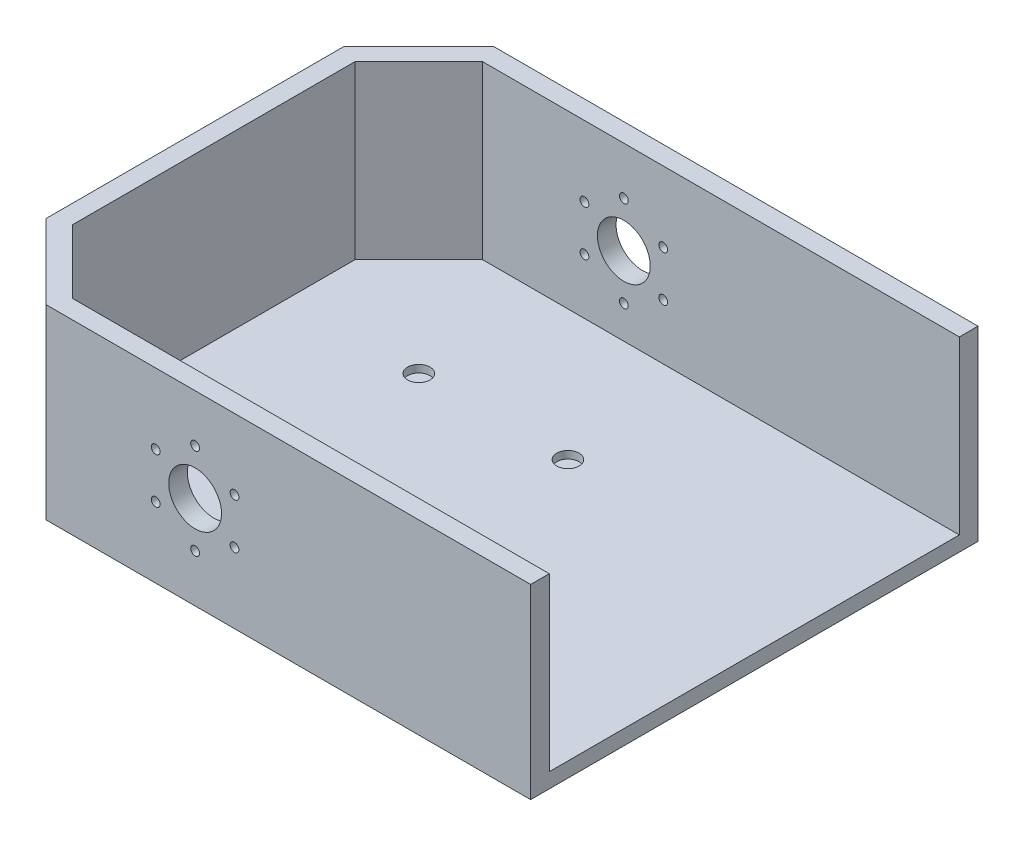
ISO-10303-21;
HEADER;
FILE_DESCRIPTION(('STEP AP214'),'2;1');
FILE_NAME('part.step','',(''),(''),'','','');
FILE_SCHEMA(('AUTOMOTIVE_DESIGN { 1 0 10303 214 1 1 1 1 }'));
ENDSEC;
DATA;
#1=APPLICATION_CONTEXT('core data for automotive mechanical design processes');
#2=APPLICATION_PROTOCOL_DEFINITION('international standard','automotive_design',2000,#1);
#3=PRODUCT_CONTEXT('',#1,'mechanical');
#4=PRODUCT('Part','Part','',(#3));
#5=PRODUCT_RELATED_PRODUCT_CATEGORY('part','',(#4));
#6=PRODUCT_DEFINITION_FORMATION('','',#4);
#7=PRODUCT_DEFINITION_CONTEXT('part definition',#1,'design');
#8=PRODUCT_DEFINITION('design','',#6,#7);
#9=PRODUCT_DEFINITION_SHAPE('','',#8);
#10=(LENGTH_UNIT() NAMED_UNIT(*) SI_UNIT(.MILLI.,.METRE.));
#11=(NAMED_UNIT(*) PLANE_ANGLE_UNIT() SI_UNIT($,.RADIAN.));
#12=(NAMED_UNIT(*) SI_UNIT($,.STERADIAN.) SOLID_ANGLE_UNIT());
#13=UNCERTAINTY_MEASURE_WITH_UNIT(LENGTH_MEASURE(1.E-05),#10,'distance_accuracy_value','');
#14=(GEOMETRIC_REPRESENTATION_CONTEXT(3) GLOBAL_UNCERTAINTY_ASSIGNED_CONTEXT((#13)) GLOBAL_UNIT_ASSIGNED_CONTEXT((#10,
#11,#12)) REPRESENTATION_CONTEXT('',''));
#15=CARTESIAN_POINT('',(0.,0.,0.));
#16=DIRECTION('',(0.,0.,1.));
#17=DIRECTION('',(1.,0.,0.));
#18=AXIS2_PLACEMENT_3D('',#15,#16,#17);
#19=CARTESIAN_POINT('',(-127.,5.08,-76.2));
#20=DIRECTION('',(1.,0.,0.));
#21=DIRECTION('',(0.,0.,-1.));
#22=AXIS2_PLACEMENT_3D('',#19,#20,#21);
#23=PLANE('',#22);
#24=DIRECTION('',(0.,1.,0.));
#25=VECTOR('',#24,1.);
#26=CARTESIAN_POINT('',(-127.,5.08,50.7999999999999));
#27=LINE('',#26,#25);
#28=CARTESIAN_POINT('',(-127.,0.,50.7999999999999));
#29=VERTEX_POINT('',#28);
#30=CARTESIAN_POINT('',(-127.,63.5,50.7999999999999));
#31=VERTEX_POINT('',#30);
#32=EDGE_CURVE('E222',#29,#31,#27,.T.);
#33=ORIENTED_EDGE('',*,*,#32,.T.);
#34=DIRECTION('',(0.,0.,1.));
#35=VECTOR('',#34,1.);
#36=CARTESIAN_POINT('',(-127.,63.5,-50.8));
#37=LINE('',#36,#35);
#38=CARTESIAN_POINT('',(-127.,63.5,-50.8));
#39=VERTEX_POINT('',#38);
#40=EDGE_CURVE('E166',#39,#31,#37,.T.);
#41=ORIENTED_EDGE('',*,*,#40,.F.);
#42=DIRECTION('',(0.,-1.,0.));
#43=VECTOR('',#42,1.);
#44=CARTESIAN_POINT('',(-127.,5.08,-50.8));
#45=LINE('',#44,#43);
#46=CARTESIAN_POINT('',(-127.,0.,-50.8));
#47=VERTEX_POINT('',#46);
#48=EDGE_CURVE('E224',#39,#47,#45,.T.);
#49=ORIENTED_EDGE('',*,*,#48,.T.);
#50=DIRECTION('',(0.,0.,1.));
#51=VECTOR('',#50,1.);
#52=CARTESIAN_POINT('',(-127.,0.,-76.2));
#53=LINE('',#52,#51);
#54=EDGE_CURVE('E212',#47,#29,#53,.T.);
#55=ORIENTED_EDGE('',*,*,#54,.T.);
#56=EDGE_LOOP('',(#33,#41,#49,#55));
#57=FACE_BOUND('',#56,.T.);
#58=ADVANCED_FACE('F41',(#57),#23,.F.);
#59=CARTESIAN_POINT('',(-127.,5.08,76.2));
#60=DIRECTION('',(0.,0.,-1.));
#61=DIRECTION('',(-1.,0.,0.));
#62=AXIS2_PLACEMENT_3D('',#59,#60,#61);
#63=PLANE('',#62);
#64=CARTESIAN_POINT('',(-64.2233937586584,39.4999999999996,76.2));
#65=DIRECTION('',(0.,0.,1.));
#66=DIRECTION('',(1.,0.,0.));
#67=AXIS2_PLACEMENT_3D('',#64,#65,#66);
#68=CIRCLE('',#67,1.50000000000001);
#69=CARTESIAN_POINT('',(-62.7233937586583,39.4999999999996,76.2));
#70=VERTEX_POINT('',#69);
#71=EDGE_CURVE('E280',#70,#70,#68,.T.);
#72=ORIENTED_EDGE('',*,*,#71,.F.);
#73=EDGE_LOOP('',(#72));
#74=FACE_BOUND('',#73,.T.);
#75=CARTESIAN_POINT('',(-64.2233937586579,23.9999999999996,76.2));
#76=DIRECTION('',(0.,0.,1.));
#77=DIRECTION('',(1.,0.,0.));
#78=AXIS2_PLACEMENT_3D('',#75,#76,#77);
#79=CIRCLE('',#78,1.50000000000002);
#80=CARTESIAN_POINT('',(-62.7233937586579,23.9999999999996,76.2));
#81=VERTEX_POINT('',#80);
#82=EDGE_CURVE('E287',#81,#81,#79,.T.);
#83=ORIENTED_EDGE('',*,*,#82,.F.);
#84=EDGE_LOOP('',(#83));
#85=FACE_BOUND('',#84,.T.);
#86=CARTESIAN_POINT('',(-50.7999999999988,16.25,76.2));
#87=DIRECTION('',(0.,0.,1.));
#88=DIRECTION('',(1.,0.,0.));
#89=AXIS2_PLACEMENT_3D('',#86,#87,#88);
#90=CIRCLE('',#89,1.5);
#91=CARTESIAN_POINT('',(-49.2999999999988,16.25,76.2));
#92=VERTEX_POINT('',#91);
#93=EDGE_CURVE('E293',#92,#92,#90,.T.);
#94=ORIENTED_EDGE('',*,*,#93,.F.);
#95=EDGE_LOOP('',(#94));
#96=FACE_BOUND('',#95,.T.);
#97=CARTESIAN_POINT('',(-37.3766062413402,24.0000000000005,76.2));
#98=DIRECTION('',(0.,0.,1.));
#99=DIRECTION('',(1.,0.,0.));
#100=AXIS2_PLACEMENT_3D('',#97,#98,#99);
#101=CIRCLE('',#100,1.50000000000001);
#102=CARTESIAN_POINT('',(-35.8766062413402,24.0000000000005,76.2));
#103=VERTEX_POINT('',#102);
#104=EDGE_CURVE('E299',#103,#103,#101,.T.);
#105=ORIENTED_EDGE('',*,*,#104,.F.);
#106=EDGE_LOOP('',(#105));
#107=FACE_BOUND('',#106,.T.);
#108=CARTESIAN_POINT('',(-37.3766062413408,39.5000000000005,76.2));
#109=DIRECTION('',(0.,0.,1.));
#110=DIRECTION('',(1.,0.,0.));
#111=AXIS2_PLACEMENT_3D('',#108,#109,#110);
#112=CIRCLE('',#111,1.5);
#113=CARTESIAN_POINT('',(-35.8766062413409,39.5000000000005,76.2));
#114=VERTEX_POINT('',#113);
#115=EDGE_CURVE('E305',#114,#114,#112,.T.);
#116=ORIENTED_EDGE('',*,*,#115,.F.);
#117=EDGE_LOOP('',(#116));
#118=FACE_BOUND('',#117,.T.);
#119=CARTESIAN_POINT('',(-50.8,47.25,76.2));
#120=DIRECTION('',(0.,0.,1.));
#121=DIRECTION('',(1.,0.,0.));
#122=AXIS2_PLACEMENT_3D('',#119,#120,#121);
#123=CIRCLE('',#122,1.5);
#124=CARTESIAN_POINT('',(-49.3,47.25,76.2));
#125=VERTEX_POINT('',#124);
#126=EDGE_CURVE('E274',#125,#125,#123,.T.);
#127=ORIENTED_EDGE('',*,*,#126,.F.);
#128=EDGE_LOOP('',(#127));
#129=FACE_BOUND('',#128,.T.);
#130=CARTESIAN_POINT('',(-50.8,31.75,76.2));
#131=DIRECTION('',(0.,0.,1.));
#132=DIRECTION('',(1.,0.,0.));
#133=AXIS2_PLACEMENT_3D('',#130,#131,#132);
#134=CIRCLE('',#133,9.);
#135=CARTESIAN_POINT('',(-41.8,31.75,76.2));
#136=VERTEX_POINT('',#135);
#137=EDGE_CURVE('E271',#136,#136,#134,.T.);
#138=ORIENTED_EDGE('',*,*,#137,.F.);
#139=EDGE_LOOP('',(#138));
#140=FACE_BOUND('',#139,.T.);
#141=DIRECTION('',(0.,-1.,0.));
#142=VECTOR('',#141,1.);
#143=CARTESIAN_POINT('',(63.5,5.08,76.2));
#144=LINE('',#143,#142);
#145=CARTESIAN_POINT('',(63.5,63.5,76.2));
#146=VERTEX_POINT('',#145);
#147=CARTESIAN_POINT('',(63.5,0.,76.2));
#148=VERTEX_POINT('',#147);
#149=EDGE_CURVE('E143',#146,#148,#144,.T.);
#150=ORIENTED_EDGE('',*,*,#149,.F.);
#151=DIRECTION('',(1.,0.,0.));
#152=VECTOR('',#151,1.);
#153=CARTESIAN_POINT('',(-101.6,63.5,76.2));
#154=LINE('',#153,#152);
#155=CARTESIAN_POINT('',(-101.6,63.5,76.2));
#156=VERTEX_POINT('',#155);
#157=EDGE_CURVE('E172',#156,#146,#154,.T.);
#158=ORIENTED_EDGE('',*,*,#157,.F.);
#159=DIRECTION('',(0.,-1.,0.));
#160=VECTOR('',#159,1.);
#161=CARTESIAN_POINT('',(-101.6,5.08,76.2));
#162=LINE('',#161,#160);
#163=CARTESIAN_POINT('',(-101.6,0.,76.2));
#164=VERTEX_POINT('',#163);
#165=EDGE_CURVE('E11',#156,#164,#162,.T.);
#166=ORIENTED_EDGE('',*,*,#165,.T.);
#167=DIRECTION('',(1.,0.,0.));
#168=VECTOR('',#167,1.);
#169=CARTESIAN_POINT('',(-127.,0.,76.2));
#170=LINE('',#169,#168);
#171=EDGE_CURVE('E217',#164,#148,#170,.T.);
#172=ORIENTED_EDGE('',*,*,#171,.T.);
#173=EDGE_LOOP('',(#150,#158,#166,#172));
#174=FACE_BOUND('',#173,.T.);
#175=ADVANCED_FACE('F366',(#74,#85,#96,#107,#118,#129,#140,#174),#63,.F.);
#176=CARTESIAN_POINT('',(63.5,5.08,-76.2));
#177=DIRECTION('',(-1.,0.,0.));
#178=DIRECTION('',(0.,0.,1.));
#179=AXIS2_PLACEMENT_3D('',#176,#177,#178);
#180=PLANE('',#179);
#181=DIRECTION('',(0.,0.,-1.));
#182=VECTOR('',#181,1.);
#183=CARTESIAN_POINT('',(63.5,0.,-76.2));
#184=LINE('',#183,#182);
#185=CARTESIAN_POINT('',(63.5,0.,-76.2));
#186=VERTEX_POINT('',#185);
#187=EDGE_CURVE('E139',#148,#186,#184,.T.);
#188=ORIENTED_EDGE('',*,*,#187,.T.);
#189=DIRECTION('',(0.,-1.,0.));
#190=VECTOR('',#189,1.);
#191=CARTESIAN_POINT('',(63.5,5.08,-76.2));
#192=LINE('',#191,#190);
#193=CARTESIAN_POINT('',(63.5,63.5,-76.2));
#194=VERTEX_POINT('',#193);
#195=EDGE_CURVE('E131',#194,#186,#192,.T.);
#196=ORIENTED_EDGE('',*,*,#195,.F.);
#197=DIRECTION('',(0.,0.,-1.));
#198=VECTOR('',#197,1.);
#199=CARTESIAN_POINT('',(63.5,63.5,-69.85));
#200=LINE('',#199,#198);
#201=CARTESIAN_POINT('',(63.5,63.5,-69.85));
#202=VERTEX_POINT('',#201);
#203=EDGE_CURVE('E136',#202,#194,#200,.T.);
#204=ORIENTED_EDGE('',*,*,#203,.F.);
#205=DIRECTION('',(0.,-1.,0.));
#206=VECTOR('',#205,1.);
#207=CARTESIAN_POINT('',(63.5,63.5,-69.85));
#208=LINE('',#207,#206);
#209=CARTESIAN_POINT('',(63.5,5.08,-69.85));
#210=VERTEX_POINT('',#209);
#211=EDGE_CURVE('E186',#202,#210,#208,.T.);
#212=ORIENTED_EDGE('',*,*,#211,.T.);
#213=DIRECTION('',(0.,0.,-1.));
#214=VECTOR('',#213,1.);
#215=CARTESIAN_POINT('',(63.5,5.08,-76.2));
#216=LINE('',#215,#214);
#217=CARTESIAN_POINT('',(63.5,5.08,69.85));
#218=VERTEX_POINT('',#217);
#219=EDGE_CURVE('E144',#218,#210,#216,.T.);
#220=ORIENTED_EDGE('',*,*,#219,.F.);
#221=DIRECTION('',(0.,-1.,0.));
#222=VECTOR('',#221,1.);
#223=CARTESIAN_POINT('',(63.5,63.5,69.85));
#224=LINE('',#223,#222);
#225=CARTESIAN_POINT('',(63.5,63.5,69.85));
#226=VERTEX_POINT('',#225);
#227=EDGE_CURVE('E209',#226,#218,#224,.T.);
#228=ORIENTED_EDGE('',*,*,#227,.F.);
#229=DIRECTION('',(0.,0.,-1.));
#230=VECTOR('',#229,1.);
#231=CARTESIAN_POINT('',(63.5,63.5,76.2));
#232=LINE('',#231,#230);
#233=EDGE_CURVE('E175',#146,#226,#232,.T.);
#234=ORIENTED_EDGE('',*,*,#233,.F.);
#235=ORIENTED_EDGE('',*,*,#149,.T.);
#236=EDGE_LOOP('',(#188,#196,#204,#212,#220,#228,#234,#235));
#237=FACE_BOUND('',#236,.T.);
#238=ADVANCED_FACE('F133',(#237),#180,.F.);
#239=CARTESIAN_POINT('',(-127.,5.08,-76.2));
#240=DIRECTION('',(0.,0.,1.));
#241=DIRECTION('',(1.,0.,0.));
#242=AXIS2_PLACEMENT_3D('',#239,#240,#241);
#243=PLANE('',#242);
#244=CARTESIAN_POINT('',(-64.2233937586584,39.4999999999996,-76.2));
#245=DIRECTION('',(0.,0.,1.));
#246=DIRECTION('',(1.,0.,0.));
#247=AXIS2_PLACEMENT_3D('',#244,#245,#246);
#248=CIRCLE('',#247,1.50000000000001);
#249=CARTESIAN_POINT('',(-62.7233937586583,39.4999999999996,-76.2));
#250=VERTEX_POINT('',#249);
#251=EDGE_CURVE('E277',#250,#250,#248,.T.);
#252=ORIENTED_EDGE('',*,*,#251,.T.);
#253=EDGE_LOOP('',(#252));
#254=FACE_BOUND('',#253,.T.);
#255=CARTESIAN_POINT('',(-64.2233937586579,23.9999999999996,-76.2));
#256=DIRECTION('',(0.,0.,1.));
#257=DIRECTION('',(1.,0.,0.));
#258=AXIS2_PLACEMENT_3D('',#255,#256,#257);
#259=CIRCLE('',#258,1.50000000000002);
#260=CARTESIAN_POINT('',(-62.7233937586579,23.9999999999996,-76.2));
#261=VERTEX_POINT('',#260);
#262=EDGE_CURVE('E284',#261,#261,#259,.T.);
#263=ORIENTED_EDGE('',*,*,#262,.T.);
#264=EDGE_LOOP('',(#263));
#265=FACE_BOUND('',#264,.T.);
#266=CARTESIAN_POINT('',(-50.7999999999988,16.25,-76.2));
#267=DIRECTION('',(0.,0.,1.));
#268=DIRECTION('',(1.,0.,0.));
#269=AXIS2_PLACEMENT_3D('',#266,#267,#268);
#270=CIRCLE('',#269,1.5);
#271=CARTESIAN_POINT('',(-49.2999999999988,16.25,-76.2));
#272=VERTEX_POINT('',#271);
#273=EDGE_CURVE('E290',#272,#272,#270,.T.);
#274=ORIENTED_EDGE('',*,*,#273,.T.);
#275=EDGE_LOOP('',(#274));
#276=FACE_BOUND('',#275,.T.);
#277=CARTESIAN_POINT('',(-37.3766062413402,24.0000000000005,-76.2));
#278=DIRECTION('',(0.,0.,1.));
#279=DIRECTION('',(1.,0.,0.));
#280=AXIS2_PLACEMENT_3D('',#277,#278,#279);
#281=CIRCLE('',#280,1.50000000000001);
#282=CARTESIAN_POINT('',(-35.8766062413402,24.0000000000005,-76.2));
#283=VERTEX_POINT('',#282);
#284=EDGE_CURVE('E296',#283,#283,#281,.T.);
#285=ORIENTED_EDGE('',*,*,#284,.T.);
#286=EDGE_LOOP('',(#285));
#287=FACE_BOUND('',#286,.T.);
#288=CARTESIAN_POINT('',(-37.3766062413408,39.5000000000005,-76.2));
#289=DIRECTION('',(0.,0.,1.));
#290=DIRECTION('',(1.,0.,0.));
#291=AXIS2_PLACEMENT_3D('',#288,#289,#290);
#292=CIRCLE('',#291,1.5);
#293=CARTESIAN_POINT('',(-35.8766062413409,39.5000000000005,-76.2));
#294=VERTEX_POINT('',#293);
#295=EDGE_CURVE('E302',#294,#294,#292,.T.);
#296=ORIENTED_EDGE('',*,*,#295,.T.);
#297=EDGE_LOOP('',(#296));
#298=FACE_BOUND('',#297,.T.);
#299=CARTESIAN_POINT('',(-50.8,47.25,-76.2));
#300=DIRECTION('',(0.,0.,1.));
#301=DIRECTION('',(1.,0.,0.));
#302=AXIS2_PLACEMENT_3D('',#299,#300,#301);
#303=CIRCLE('',#302,1.5);
#304=CARTESIAN_POINT('',(-49.3,47.25,-76.2));
#305=VERTEX_POINT('',#304);
#306=EDGE_CURVE('E308',#305,#305,#303,.T.);
#307=ORIENTED_EDGE('',*,*,#306,.T.);
#308=EDGE_LOOP('',(#307));
#309=FACE_BOUND('',#308,.T.);
#310=CARTESIAN_POINT('',(-50.8,31.75,-76.2));
#311=DIRECTION('',(0.,0.,1.));
#312=DIRECTION('',(1.,0.,0.));
#313=AXIS2_PLACEMENT_3D('',#310,#311,#312);
#314=CIRCLE('',#313,9.);
#315=CARTESIAN_POINT('',(-41.8,31.75,-76.2));
#316=VERTEX_POINT('',#315);
#317=EDGE_CURVE('E236',#316,#316,#314,.T.);
#318=ORIENTED_EDGE('',*,*,#317,.T.);
#319=EDGE_LOOP('',(#318));
#320=FACE_BOUND('',#319,.T.);
#321=DIRECTION('',(-1.,0.,0.));
#322=VECTOR('',#321,1.);
#323=CARTESIAN_POINT('',(-127.,0.,-76.2));
#324=LINE('',#323,#322);
#325=CARTESIAN_POINT('',(-101.6,0.,-76.2));
#326=VERTEX_POINT('',#325);
#327=EDGE_CURVE('E214',#186,#326,#324,.T.);
#328=ORIENTED_EDGE('',*,*,#327,.T.);
#329=DIRECTION('',(0.,1.,0.));
#330=VECTOR('',#329,1.);
#331=CARTESIAN_POINT('',(-101.6,5.08,-76.2));
#332=LINE('',#331,#330);
#333=CARTESIAN_POINT('',(-101.6,63.5,-76.2));
#334=VERTEX_POINT('',#333);
#335=EDGE_CURVE('E51',#326,#334,#332,.T.);
#336=ORIENTED_EDGE('',*,*,#335,.T.);
#337=DIRECTION('',(-1.,0.,0.));
#338=VECTOR('',#337,1.);
#339=CARTESIAN_POINT('',(63.5,63.5,-76.2));
#340=LINE('',#339,#338);
#341=EDGE_CURVE('E147',#194,#334,#340,.T.);
#342=ORIENTED_EDGE('',*,*,#341,.F.);
#343=ORIENTED_EDGE('',*,*,#195,.T.);
#344=EDGE_LOOP('',(#328,#336,#342,#343));
#345=FACE_BOUND('',#344,.T.);
#346=ADVANCED_FACE('F148',(#254,#265,#276,#287,#298,#309,#320,#345),#243,.F.);
#347=CARTESIAN_POINT('',(0.,5.08,0.));
#348=DIRECTION('',(0.,1.,0.));
#349=DIRECTION('',(0.,0.,1.));
#350=AXIS2_PLACEMENT_3D('',#347,#348,#349);
#351=PLANE('',#350);
#352=CARTESIAN_POINT('',(-76.2,5.08,25.4));
#353=DIRECTION('',(0.,1.,0.));
#354=DIRECTION('',(0.,0.,1.));
#355=AXIS2_PLACEMENT_3D('',#352,#353,#354);
#356=CIRCLE('',#355,3.81);
#357=CARTESIAN_POINT('',(-76.2,5.08,29.21));
#358=VERTEX_POINT('',#357);
#359=EDGE_CURVE('E322',#358,#358,#356,.T.);
#360=ORIENTED_EDGE('',*,*,#359,.F.);
#361=EDGE_LOOP('',(#360));
#362=FACE_BOUND('',#361,.T.);
#363=CARTESIAN_POINT('',(-25.4,5.08,25.4));
#364=DIRECTION('',(0.,1.,0.));
#365=DIRECTION('',(0.,0.,1.));
#366=AXIS2_PLACEMENT_3D('',#363,#364,#365);
#367=CIRCLE('',#366,3.81);
#368=CARTESIAN_POINT('',(-25.4,5.08,29.21));
#369=VERTEX_POINT('',#368);
#370=EDGE_CURVE('E328',#369,#369,#367,.T.);
#371=ORIENTED_EDGE('',*,*,#370,.F.);
#372=EDGE_LOOP('',(#371));
#373=FACE_BOUND('',#372,.T.);
#374=CARTESIAN_POINT('',(-25.4,5.08,-25.4));
#375=DIRECTION('',(0.,1.,0.));
#376=DIRECTION('',(0.,0.,1.));
#377=AXIS2_PLACEMENT_3D('',#374,#375,#376);
#378=CIRCLE('',#377,3.81);
#379=CARTESIAN_POINT('',(-25.4,5.08,-21.59));
#380=VERTEX_POINT('',#379);
#381=EDGE_CURVE('E316',#380,#380,#378,.T.);
#382=ORIENTED_EDGE('',*,*,#381,.F.);
#383=EDGE_LOOP('',(#382));
#384=FACE_BOUND('',#383,.T.);
#385=CARTESIAN_POINT('',(-76.2,5.08,-25.4));
#386=DIRECTION('',(0.,1.,0.));
#387=DIRECTION('',(0.,0.,1.));
#388=AXIS2_PLACEMENT_3D('',#385,#386,#387);
#389=CIRCLE('',#388,3.81);
#390=CARTESIAN_POINT('',(-76.2,5.08,-21.59));
#391=VERTEX_POINT('',#390);
#392=EDGE_CURVE('E313',#391,#391,#389,.T.);
#393=ORIENTED_EDGE('',*,*,#392,.F.);
#394=EDGE_LOOP('',(#393));
#395=FACE_BOUND('',#394,.T.);
#396=DIRECTION('',(1.,0.,0.));
#397=VECTOR('',#396,1.);
#398=CARTESIAN_POINT('',(57.15,5.08,-69.85));
#399=LINE('',#398,#397);
#400=CARTESIAN_POINT('',(-98.9697438789308,5.08,-69.85));
#401=VERTEX_POINT('',#400);
#402=EDGE_CURVE('E59',#401,#210,#399,.T.);
#403=ORIENTED_EDGE('',*,*,#402,.F.);
#404=DIRECTION('',(0.707106781186549,0.,-0.707106781186546));
#405=VECTOR('',#404,1.);
#406=CARTESIAN_POINT('',(-98.9697438789308,5.08,-69.85));
#407=LINE('',#406,#405);
#408=CARTESIAN_POINT('',(-120.65,5.08,-48.1697438789308));
#409=VERTEX_POINT('',#408);
#410=EDGE_CURVE('E63',#409,#401,#407,.T.);
#411=ORIENTED_EDGE('',*,*,#410,.F.);
#412=DIRECTION('',(0.,0.,-1.));
#413=VECTOR('',#412,1.);
#414=CARTESIAN_POINT('',(-120.65,5.08,-48.1697438789308));
#415=LINE('',#414,#413);
#416=CARTESIAN_POINT('',(-120.65,5.08,48.1697438789307));
#417=VERTEX_POINT('',#416);
#418=EDGE_CURVE('E193',#417,#409,#415,.T.);
#419=ORIENTED_EDGE('',*,*,#418,.F.);
#420=DIRECTION('',(-0.707106781186546,0.,-0.707106781186549));
#421=VECTOR('',#420,1.);
#422=CARTESIAN_POINT('',(-120.65,5.08,48.1697438789307));
#423=LINE('',#422,#421);
#424=CARTESIAN_POINT('',(-98.9697438789309,5.08,69.85));
#425=VERTEX_POINT('',#424);
#426=EDGE_CURVE('E190',#425,#417,#423,.T.);
#427=ORIENTED_EDGE('',*,*,#426,.F.);
#428=DIRECTION('',(-1.,0.,0.));
#429=VECTOR('',#428,1.);
#430=CARTESIAN_POINT('',(-98.9697438789309,5.08,69.85));
#431=LINE('',#430,#429);
#432=EDGE_CURVE('E187',#218,#425,#431,.T.);
#433=ORIENTED_EDGE('',*,*,#432,.F.);
#434=ORIENTED_EDGE('',*,*,#219,.T.);
#435=EDGE_LOOP('',(#403,#411,#419,#427,#433,#434));
#436=FACE_BOUND('',#435,.T.);
#437=ADVANCED_FACE('F339',(#362,#373,#384,#395,#436),#351,.T.);
#438=CARTESIAN_POINT('',(0.,0.,0.));
#439=DIRECTION('',(0.,1.,0.));
#440=DIRECTION('',(0.,0.,1.));
#441=AXIS2_PLACEMENT_3D('',#438,#439,#440);
#442=PLANE('',#441);
#443=ORIENTED_EDGE('',*,*,#54,.F.);
#444=DIRECTION('',(-0.707106781186549,0.,0.707106781186546));
#445=VECTOR('',#444,1.);
#446=CARTESIAN_POINT('',(-127.,0.,-50.8));
#447=LINE('',#446,#445);
#448=EDGE_CURVE('E229',#47,#326,#447,.F.);
#449=ORIENTED_EDGE('',*,*,#448,.T.);
#450=ORIENTED_EDGE('',*,*,#327,.F.);
#451=ORIENTED_EDGE('',*,*,#187,.F.);
#452=ORIENTED_EDGE('',*,*,#171,.F.);
#453=DIRECTION('',(0.707106781186546,0.,0.707106781186549));
#454=VECTOR('',#453,1.);
#455=CARTESIAN_POINT('',(-101.6,0.,76.2));
#456=LINE('',#455,#454);
#457=EDGE_CURVE('E227',#164,#29,#456,.F.);
#458=ORIENTED_EDGE('',*,*,#457,.T.);
#459=EDGE_LOOP('',(#443,#449,#450,#451,#452,#458));
#460=FACE_BOUND('',#459,.T.);
#461=ADVANCED_FACE('F342',(#460),#442,.F.);
#462=CARTESIAN_POINT('',(-127.,5.08,-50.8));
#463=DIRECTION('',(0.707106781186546,0.,0.707106781186548));
#464=DIRECTION('',(0.,-1.,0.));
#465=AXIS2_PLACEMENT_3D('',#462,#463,#464);
#466=PLANE('',#465);
#467=ORIENTED_EDGE('',*,*,#48,.F.);
#468=DIRECTION('',(-0.707106781186549,0.,0.707106781186546));
#469=VECTOR('',#468,1.);
#470=CARTESIAN_POINT('',(-101.6,63.5,-76.2));
#471=LINE('',#470,#469);
#472=EDGE_CURVE('E153',#334,#39,#471,.T.);
#473=ORIENTED_EDGE('',*,*,#472,.F.);
#474=ORIENTED_EDGE('',*,*,#335,.F.);
#475=ORIENTED_EDGE('',*,*,#448,.F.);
#476=EDGE_LOOP('',(#467,#473,#474,#475));
#477=FACE_BOUND('',#476,.T.);
#478=ADVANCED_FACE('F378',(#477),#466,.F.);
#479=CARTESIAN_POINT('',(-101.6,5.08,76.2));
#480=DIRECTION('',(0.707106781186549,0.,-0.707106781186546));
#481=DIRECTION('',(0.,-1.,0.));
#482=AXIS2_PLACEMENT_3D('',#479,#480,#481);
#483=PLANE('',#482);
#484=ORIENTED_EDGE('',*,*,#165,.F.);
#485=DIRECTION('',(0.707106781186546,0.,0.707106781186549));
#486=VECTOR('',#485,1.);
#487=CARTESIAN_POINT('',(-127.,63.5,50.7999999999999));
#488=LINE('',#487,#486);
#489=EDGE_CURVE('E169',#31,#156,#488,.T.);
#490=ORIENTED_EDGE('',*,*,#489,.F.);
#491=ORIENTED_EDGE('',*,*,#32,.F.);
#492=ORIENTED_EDGE('',*,*,#457,.F.);
#493=EDGE_LOOP('',(#484,#490,#491,#492));
#494=FACE_BOUND('',#493,.T.);
#495=ADVANCED_FACE('F44',(#494),#483,.F.);
#496=CARTESIAN_POINT('',(-98.9697438789309,63.5,69.85));
#497=DIRECTION('',(0.,0.,1.));
#498=DIRECTION('',(1.,0.,0.));
#499=AXIS2_PLACEMENT_3D('',#496,#497,#498);
#500=PLANE('',#499);
#501=CARTESIAN_POINT('',(-64.2233937586584,39.4999999999996,69.85));
#502=DIRECTION('',(0.,0.,1.));
#503=DIRECTION('',(1.,0.,0.));
#504=AXIS2_PLACEMENT_3D('',#501,#502,#503);
#505=CIRCLE('',#504,1.50000000000001);
#506=CARTESIAN_POINT('',(-62.7233937586583,39.4999999999996,69.85));
#507=VERTEX_POINT('',#506);
#508=EDGE_CURVE('E162',#507,#507,#505,.T.);
#509=ORIENTED_EDGE('',*,*,#508,.T.);
#510=EDGE_LOOP('',(#509));
#511=FACE_BOUND('',#510,.T.);
#512=CARTESIAN_POINT('',(-64.2233937586579,23.9999999999996,69.85));
#513=DIRECTION('',(0.,0.,1.));
#514=DIRECTION('',(1.,0.,0.));
#515=AXIS2_PLACEMENT_3D('',#512,#513,#514);
#516=CIRCLE('',#515,1.50000000000002);
#517=CARTESIAN_POINT('',(-62.7233937586579,23.9999999999996,69.85));
#518=VERTEX_POINT('',#517);
#519=EDGE_CURVE('E254',#518,#518,#516,.T.);
#520=ORIENTED_EDGE('',*,*,#519,.T.);
#521=EDGE_LOOP('',(#520));
#522=FACE_BOUND('',#521,.T.);
#523=CARTESIAN_POINT('',(-50.7999999999988,16.25,69.85));
#524=DIRECTION('',(0.,0.,1.));
#525=DIRECTION('',(1.,0.,0.));
#526=AXIS2_PLACEMENT_3D('',#523,#524,#525);
#527=CIRCLE('',#526,1.5);
#528=CARTESIAN_POINT('',(-49.2999999999988,16.25,69.85));
#529=VERTEX_POINT('',#528);
#530=EDGE_CURVE('E251',#529,#529,#527,.T.);
#531=ORIENTED_EDGE('',*,*,#530,.T.);
#532=EDGE_LOOP('',(#531));
#533=FACE_BOUND('',#532,.T.);
#534=CARTESIAN_POINT('',(-37.3766062413402,24.0000000000005,69.85));
#535=DIRECTION('',(0.,0.,1.));
#536=DIRECTION('',(1.,0.,0.));
#537=AXIS2_PLACEMENT_3D('',#534,#535,#536);
#538=CIRCLE('',#537,1.50000000000001);
#539=CARTESIAN_POINT('',(-35.8766062413402,24.0000000000005,69.85));
#540=VERTEX_POINT('',#539);
#541=EDGE_CURVE('E248',#540,#540,#538,.T.);
#542=ORIENTED_EDGE('',*,*,#541,.T.);
#543=EDGE_LOOP('',(#542));
#544=FACE_BOUND('',#543,.T.);
#545=CARTESIAN_POINT('',(-37.3766062413408,39.5000000000005,69.85));
#546=DIRECTION('',(0.,0.,1.));
#547=DIRECTION('',(1.,0.,0.));
#548=AXIS2_PLACEMENT_3D('',#545,#546,#547);
#549=CIRCLE('',#548,1.5);
#550=CARTESIAN_POINT('',(-35.8766062413409,39.5000000000005,69.85));
#551=VERTEX_POINT('',#550);
#552=EDGE_CURVE('E244',#551,#551,#549,.T.);
#553=ORIENTED_EDGE('',*,*,#552,.T.);
#554=EDGE_LOOP('',(#553));
#555=FACE_BOUND('',#554,.T.);
#556=CARTESIAN_POINT('',(-50.8,47.25,69.85));
#557=DIRECTION('',(0.,0.,1.));
#558=DIRECTION('',(1.,0.,0.));
#559=AXIS2_PLACEMENT_3D('',#556,#557,#558);
#560=CIRCLE('',#559,1.5);
#561=CARTESIAN_POINT('',(-49.3,47.25,69.85));
#562=VERTEX_POINT('',#561);
#563=EDGE_CURVE('E240',#562,#562,#560,.T.);
#564=ORIENTED_EDGE('',*,*,#563,.T.);
#565=EDGE_LOOP('',(#564));
#566=FACE_BOUND('',#565,.T.);
#567=CARTESIAN_POINT('',(-50.8,31.75,69.85));
#568=DIRECTION('',(0.,0.,1.));
#569=DIRECTION('',(1.,0.,0.));
#570=AXIS2_PLACEMENT_3D('',#567,#568,#569);
#571=CIRCLE('',#570,9.);
#572=CARTESIAN_POINT('',(-41.8,31.75,69.85));
#573=VERTEX_POINT('',#572);
#574=EDGE_CURVE('E235',#573,#573,#571,.T.);
#575=ORIENTED_EDGE('',*,*,#574,.T.);
#576=EDGE_LOOP('',(#575));
#577=FACE_BOUND('',#576,.T.);
#578=ORIENTED_EDGE('',*,*,#432,.T.);
#579=DIRECTION('',(0.,-1.,0.));
#580=VECTOR('',#579,1.);
#581=CARTESIAN_POINT('',(-98.9697438789309,63.5,69.85));
#582=LINE('',#581,#580);
#583=CARTESIAN_POINT('',(-98.9697438789309,63.5,69.85));
#584=VERTEX_POINT('',#583);
#585=EDGE_CURVE('E206',#584,#425,#582,.T.);
#586=ORIENTED_EDGE('',*,*,#585,.F.);
#587=DIRECTION('',(-1.,0.,0.));
#588=VECTOR('',#587,1.);
#589=CARTESIAN_POINT('',(57.15,63.5,69.85));
#590=LINE('',#589,#588);
#591=EDGE_CURVE('E177',#226,#584,#590,.T.);
#592=ORIENTED_EDGE('',*,*,#591,.F.);
#593=ORIENTED_EDGE('',*,*,#227,.T.);
#594=EDGE_LOOP('',(#578,#586,#592,#593));
#595=FACE_BOUND('',#594,.T.);
#596=ADVANCED_FACE('F386',(#511,#522,#533,#544,#555,#566,#577,#595),#500,.F.);
#597=CARTESIAN_POINT('',(-120.65,63.5,48.1697438789307));
#598=DIRECTION('',(-0.707106781186549,0.,0.707106781186545));
#599=DIRECTION('',(0.707106781186546,0.,0.70710678118655));
#600=AXIS2_PLACEMENT_3D('',#597,#598,#599);
#601=PLANE('',#600);
#602=ORIENTED_EDGE('',*,*,#426,.T.);
#603=DIRECTION('',(0.,-1.,0.));
#604=VECTOR('',#603,1.);
#605=CARTESIAN_POINT('',(-120.65,63.5,48.1697438789307));
#606=LINE('',#605,#604);
#607=CARTESIAN_POINT('',(-120.65,63.5,48.1697438789307));
#608=VERTEX_POINT('',#607);
#609=EDGE_CURVE('E203',#608,#417,#606,.T.);
#610=ORIENTED_EDGE('',*,*,#609,.F.);
#611=DIRECTION('',(-0.707106781186546,0.,-0.707106781186549));
#612=VECTOR('',#611,1.);
#613=CARTESIAN_POINT('',(-120.65,63.5,48.1697438789307));
#614=LINE('',#613,#612);
#615=EDGE_CURVE('E179',#584,#608,#614,.T.);
#616=ORIENTED_EDGE('',*,*,#615,.F.);
#617=ORIENTED_EDGE('',*,*,#585,.T.);
#618=EDGE_LOOP('',(#602,#610,#616,#617));
#619=FACE_BOUND('',#618,.T.);
#620=ADVANCED_FACE('F406',(#619),#601,.F.);
#621=CARTESIAN_POINT('',(-120.65,63.5,-48.1697438789308));
#622=DIRECTION('',(-1.,0.,0.));
#623=DIRECTION('',(0.,0.,1.));
#624=AXIS2_PLACEMENT_3D('',#621,#622,#623);
#625=PLANE('',#624);
#626=ORIENTED_EDGE('',*,*,#418,.T.);
#627=DIRECTION('',(0.,-1.,0.));
#628=VECTOR('',#627,1.);
#629=CARTESIAN_POINT('',(-120.65,63.5,-48.1697438789308));
#630=LINE('',#629,#628);
#631=CARTESIAN_POINT('',(-120.65,63.5,-48.1697438789308));
#632=VERTEX_POINT('',#631);
#633=EDGE_CURVE('E200',#632,#409,#630,.T.);
#634=ORIENTED_EDGE('',*,*,#633,.F.);
#635=DIRECTION('',(0.,0.,-1.));
#636=VECTOR('',#635,1.);
#637=CARTESIAN_POINT('',(-120.65,63.5,-48.1697438789308));
#638=LINE('',#637,#636);
#639=EDGE_CURVE('E181',#608,#632,#638,.T.);
#640=ORIENTED_EDGE('',*,*,#639,.F.);
#641=ORIENTED_EDGE('',*,*,#609,.T.);
#642=EDGE_LOOP('',(#626,#634,#640,#641));
#643=FACE_BOUND('',#642,.T.);
#644=ADVANCED_FACE('F410',(#643),#625,.F.);
#645=CARTESIAN_POINT('',(-98.9697438789308,63.5,-69.85));
#646=DIRECTION('',(-0.707106781186546,0.,-0.707106781186549));
#647=DIRECTION('',(-0.707106781186549,0.,0.707106781186546));
#648=AXIS2_PLACEMENT_3D('',#645,#646,#647);
#649=PLANE('',#648);
#650=ORIENTED_EDGE('',*,*,#410,.T.);
#651=DIRECTION('',(0.,-1.,0.));
#652=VECTOR('',#651,1.);
#653=CARTESIAN_POINT('',(-98.9697438789308,63.5,-69.85));
#654=LINE('',#653,#652);
#655=CARTESIAN_POINT('',(-98.9697438789308,63.5,-69.85));
#656=VERTEX_POINT('',#655);
#657=EDGE_CURVE('E197',#656,#401,#654,.T.);
#658=ORIENTED_EDGE('',*,*,#657,.F.);
#659=DIRECTION('',(0.707106781186549,0.,-0.707106781186546));
#660=VECTOR('',#659,1.);
#661=CARTESIAN_POINT('',(-98.9697438789308,63.5,-69.85));
#662=LINE('',#661,#660);
#663=EDGE_CURVE('E183',#632,#656,#662,.T.);
#664=ORIENTED_EDGE('',*,*,#663,.F.);
#665=ORIENTED_EDGE('',*,*,#633,.T.);
#666=EDGE_LOOP('',(#650,#658,#664,#665));
#667=FACE_BOUND('',#666,.T.);
#668=ADVANCED_FACE('F414',(#667),#649,.F.);
#669=CARTESIAN_POINT('',(57.15,63.5,-69.85));
#670=DIRECTION('',(0.,0.,-1.));
#671=DIRECTION('',(-1.,0.,0.));
#672=AXIS2_PLACEMENT_3D('',#669,#670,#671);
#673=PLANE('',#672);
#674=CARTESIAN_POINT('',(-64.2233937586584,39.4999999999996,-69.85));
#675=DIRECTION('',(0.,0.,-1.));
#676=DIRECTION('',(-1.,0.,0.));
#677=AXIS2_PLACEMENT_3D('',#674,#675,#676);
#678=CIRCLE('',#677,1.50000000000001);
#679=CARTESIAN_POINT('',(-65.7233937586584,39.4999999999996,-69.85));
#680=VERTEX_POINT('',#679);
#681=EDGE_CURVE('E46',#680,#680,#678,.T.);
#682=ORIENTED_EDGE('',*,*,#681,.T.);
#683=EDGE_LOOP('',(#682));
#684=FACE_BOUND('',#683,.T.);
#685=CARTESIAN_POINT('',(-64.2233937586579,23.9999999999996,-69.85));
#686=DIRECTION('',(0.,0.,-1.));
#687=DIRECTION('',(-1.,0.,0.));
#688=AXIS2_PLACEMENT_3D('',#685,#686,#687);
#689=CIRCLE('',#688,1.50000000000002);
#690=CARTESIAN_POINT('',(-65.7233937586579,23.9999999999996,-69.85));
#691=VERTEX_POINT('',#690);
#692=EDGE_CURVE('E252',#691,#691,#689,.T.);
#693=ORIENTED_EDGE('',*,*,#692,.T.);
#694=EDGE_LOOP('',(#693));
#695=FACE_BOUND('',#694,.T.);
#696=CARTESIAN_POINT('',(-50.7999999999988,16.25,-69.85));
#697=DIRECTION('',(0.,0.,-1.));
#698=DIRECTION('',(-1.,0.,0.));
#699=AXIS2_PLACEMENT_3D('',#696,#697,#698);
#700=CIRCLE('',#699,1.5);
#701=CARTESIAN_POINT('',(-52.2999999999988,16.25,-69.85));
#702=VERTEX_POINT('',#701);
#703=EDGE_CURVE('E249',#702,#702,#700,.T.);
#704=ORIENTED_EDGE('',*,*,#703,.T.);
#705=EDGE_LOOP('',(#704));
#706=FACE_BOUND('',#705,.T.);
#707=CARTESIAN_POINT('',(-37.3766062413402,24.0000000000005,-69.85));
#708=DIRECTION('',(0.,0.,-1.));
#709=DIRECTION('',(-1.,0.,0.));
#710=AXIS2_PLACEMENT_3D('',#707,#708,#709);
#711=CIRCLE('',#710,1.50000000000001);
#712=CARTESIAN_POINT('',(-38.8766062413403,24.0000000000005,-69.85));
#713=VERTEX_POINT('',#712);
#714=EDGE_CURVE('E245',#713,#713,#711,.T.);
#715=ORIENTED_EDGE('',*,*,#714,.T.);
#716=EDGE_LOOP('',(#715));
#717=FACE_BOUND('',#716,.T.);
#718=CARTESIAN_POINT('',(-37.3766062413408,39.5000000000005,-69.85));
#719=DIRECTION('',(0.,0.,-1.));
#720=DIRECTION('',(-1.,0.,0.));
#721=AXIS2_PLACEMENT_3D('',#718,#719,#720);
#722=CIRCLE('',#721,1.5);
#723=CARTESIAN_POINT('',(-38.8766062413408,39.5000000000005,-69.85));
#724=VERTEX_POINT('',#723);
#725=EDGE_CURVE('E241',#724,#724,#722,.T.);
#726=ORIENTED_EDGE('',*,*,#725,.T.);
#727=EDGE_LOOP('',(#726));
#728=FACE_BOUND('',#727,.T.);
#729=CARTESIAN_POINT('',(-50.8,47.25,-69.85));
#730=DIRECTION('',(0.,0.,-1.));
#731=DIRECTION('',(-1.,0.,0.));
#732=AXIS2_PLACEMENT_3D('',#729,#730,#731);
#733=CIRCLE('',#732,1.5);
#734=CARTESIAN_POINT('',(-52.3,47.25,-69.85));
#735=VERTEX_POINT('',#734);
#736=EDGE_CURVE('E237',#735,#735,#733,.T.);
#737=ORIENTED_EDGE('',*,*,#736,.T.);
#738=EDGE_LOOP('',(#737));
#739=FACE_BOUND('',#738,.T.);
#740=CARTESIAN_POINT('',(-50.8,31.75,-69.85));
#741=DIRECTION('',(0.,0.,-1.));
#742=DIRECTION('',(-1.,0.,0.));
#743=AXIS2_PLACEMENT_3D('',#740,#741,#742);
#744=CIRCLE('',#743,9.);
#745=CARTESIAN_POINT('',(-59.8,31.75,-69.85));
#746=VERTEX_POINT('',#745);
#747=EDGE_CURVE('E232',#746,#746,#744,.T.);
#748=ORIENTED_EDGE('',*,*,#747,.T.);
#749=EDGE_LOOP('',(#748));
#750=FACE_BOUND('',#749,.T.);
#751=ORIENTED_EDGE('',*,*,#402,.T.);
#752=ORIENTED_EDGE('',*,*,#211,.F.);
#753=DIRECTION('',(1.,0.,0.));
#754=VECTOR('',#753,1.);
#755=CARTESIAN_POINT('',(57.15,63.5,-69.85));
#756=LINE('',#755,#754);
#757=EDGE_CURVE('E157',#656,#202,#756,.T.);
#758=ORIENTED_EDGE('',*,*,#757,.F.);
#759=ORIENTED_EDGE('',*,*,#657,.T.);
#760=EDGE_LOOP('',(#751,#752,#758,#759));
#761=FACE_BOUND('',#760,.T.);
#762=ADVANCED_FACE('F416',(#684,#695,#706,#717,#728,#739,#750,#761),#673,.F.);
#763=CARTESIAN_POINT('',(0.,63.5,0.));
#764=DIRECTION('',(0.,1.,0.));
#765=DIRECTION('',(0.,0.,1.));
#766=AXIS2_PLACEMENT_3D('',#763,#764,#765);
#767=PLANE('',#766);
#768=ORIENTED_EDGE('',*,*,#203,.T.);
#769=ORIENTED_EDGE('',*,*,#341,.T.);
#770=ORIENTED_EDGE('',*,*,#472,.T.);
#771=ORIENTED_EDGE('',*,*,#40,.T.);
#772=ORIENTED_EDGE('',*,*,#489,.T.);
#773=ORIENTED_EDGE('',*,*,#157,.T.);
#774=ORIENTED_EDGE('',*,*,#233,.T.);
#775=ORIENTED_EDGE('',*,*,#591,.T.);
#776=ORIENTED_EDGE('',*,*,#615,.T.);
#777=ORIENTED_EDGE('',*,*,#639,.T.);
#778=ORIENTED_EDGE('',*,*,#663,.T.);
#779=ORIENTED_EDGE('',*,*,#757,.T.);
#780=EDGE_LOOP('',(#768,#769,#770,#771,#772,#773,#774,#775,#776,#777,#778,#779));
#781=FACE_BOUND('',#780,.T.);
#782=ADVANCED_FACE('F155',(#781),#767,.T.);
#783=CARTESIAN_POINT('',(-50.8,31.75,-76.2));
#784=DIRECTION('',(0.,0.,1.));
#785=DIRECTION('',(1.,0.,0.));
#786=AXIS2_PLACEMENT_3D('',#783,#784,#785);
#787=CYLINDRICAL_SURFACE('',#786,9.);
#788=ORIENTED_EDGE('',*,*,#317,.F.);
#789=EDGE_LOOP('',(#788));
#790=FACE_BOUND('',#789,.T.);
#791=ORIENTED_EDGE('',*,*,#747,.F.);
#792=EDGE_LOOP('',(#791));
#793=FACE_BOUND('',#792,.T.);
#794=ADVANCED_FACE('F425',(#790,#793),#787,.F.);
#795=CARTESIAN_POINT('',(-50.8,47.25,-76.2));
#796=DIRECTION('',(0.,0.,1.));
#797=DIRECTION('',(1.,0.,0.));
#798=AXIS2_PLACEMENT_3D('',#795,#796,#797);
#799=CYLINDRICAL_SURFACE('',#798,1.5);
#800=ORIENTED_EDGE('',*,*,#306,.F.);
#801=EDGE_LOOP('',(#800));
#802=FACE_BOUND('',#801,.T.);
#803=ORIENTED_EDGE('',*,*,#736,.F.);
#804=EDGE_LOOP('',(#803));
#805=FACE_BOUND('',#804,.T.);
#806=ADVANCED_FACE('F518',(#802,#805),#799,.F.);
#807=CARTESIAN_POINT('',(-37.3766062413408,39.5000000000005,-76.2));
#808=DIRECTION('',(0.,0.,1.));
#809=DIRECTION('',(1.,0.,0.));
#810=AXIS2_PLACEMENT_3D('',#807,#808,#809);
#811=CYLINDRICAL_SURFACE('',#810,1.5);
#812=ORIENTED_EDGE('',*,*,#295,.F.);
#813=EDGE_LOOP('',(#812));
#814=FACE_BOUND('',#813,.T.);
#815=ORIENTED_EDGE('',*,*,#725,.F.);
#816=EDGE_LOOP('',(#815));
#817=FACE_BOUND('',#816,.T.);
#818=ADVANCED_FACE('F528',(#814,#817),#811,.F.);
#819=CARTESIAN_POINT('',(-37.3766062413402,24.0000000000005,-76.2));
#820=DIRECTION('',(0.,0.,1.));
#821=DIRECTION('',(1.,0.,0.));
#822=AXIS2_PLACEMENT_3D('',#819,#820,#821);
#823=CYLINDRICAL_SURFACE('',#822,1.50000000000001);
#824=ORIENTED_EDGE('',*,*,#284,.F.);
#825=EDGE_LOOP('',(#824));
#826=FACE_BOUND('',#825,.T.);
#827=ORIENTED_EDGE('',*,*,#714,.F.);
#828=EDGE_LOOP('',(#827));
#829=FACE_BOUND('',#828,.T.);
#830=ADVANCED_FACE('F538',(#826,#829),#823,.F.);
#831=CARTESIAN_POINT('',(-50.7999999999988,16.25,-76.2));
#832=DIRECTION('',(0.,0.,1.));
#833=DIRECTION('',(1.,0.,0.));
#834=AXIS2_PLACEMENT_3D('',#831,#832,#833);
#835=CYLINDRICAL_SURFACE('',#834,1.5);
#836=ORIENTED_EDGE('',*,*,#273,.F.);
#837=EDGE_LOOP('',(#836));
#838=FACE_BOUND('',#837,.T.);
#839=ORIENTED_EDGE('',*,*,#703,.F.);
#840=EDGE_LOOP('',(#839));
#841=FACE_BOUND('',#840,.T.);
#842=ADVANCED_FACE('F549',(#838,#841),#835,.F.);
#843=CARTESIAN_POINT('',(-64.2233937586579,23.9999999999996,-76.2));
#844=DIRECTION('',(0.,0.,1.));
#845=DIRECTION('',(1.,0.,0.));
#846=AXIS2_PLACEMENT_3D('',#843,#844,#845);
#847=CYLINDRICAL_SURFACE('',#846,1.50000000000002);
#848=ORIENTED_EDGE('',*,*,#262,.F.);
#849=EDGE_LOOP('',(#848));
#850=FACE_BOUND('',#849,.T.);
#851=ORIENTED_EDGE('',*,*,#692,.F.);
#852=EDGE_LOOP('',(#851));
#853=FACE_BOUND('',#852,.T.);
#854=ADVANCED_FACE('F560',(#850,#853),#847,.F.);
#855=CARTESIAN_POINT('',(-64.2233937586584,39.4999999999996,-76.2));
#856=DIRECTION('',(0.,0.,1.));
#857=DIRECTION('',(1.,0.,0.));
#858=AXIS2_PLACEMENT_3D('',#855,#856,#857);
#859=CYLINDRICAL_SURFACE('',#858,1.50000000000001);
#860=ORIENTED_EDGE('',*,*,#251,.F.);
#861=EDGE_LOOP('',(#860));
#862=FACE_BOUND('',#861,.T.);
#863=ORIENTED_EDGE('',*,*,#681,.F.);
#864=EDGE_LOOP('',(#863));
#865=FACE_BOUND('',#864,.T.);
#866=ADVANCED_FACE('F362',(#862,#865),#859,.F.);
#867=ORIENTED_EDGE('',*,*,#137,.T.);
#868=EDGE_LOOP('',(#867));
#869=FACE_BOUND('',#868,.T.);
#870=ORIENTED_EDGE('',*,*,#574,.F.);
#871=EDGE_LOOP('',(#870));
#872=FACE_BOUND('',#871,.T.);
#873=ADVANCED_FACE('F520',(#869,#872),#787,.F.);
#874=ORIENTED_EDGE('',*,*,#126,.T.);
#875=EDGE_LOOP('',(#874));
#876=FACE_BOUND('',#875,.T.);
#877=ORIENTED_EDGE('',*,*,#563,.F.);
#878=EDGE_LOOP('',(#877));
#879=FACE_BOUND('',#878,.T.);
#880=ADVANCED_FACE('F530',(#876,#879),#799,.F.);
#881=ORIENTED_EDGE('',*,*,#115,.T.);
#882=EDGE_LOOP('',(#881));
#883=FACE_BOUND('',#882,.T.);
#884=ORIENTED_EDGE('',*,*,#552,.F.);
#885=EDGE_LOOP('',(#884));
#886=FACE_BOUND('',#885,.T.);
#887=ADVANCED_FACE('F541',(#883,#886),#811,.F.);
#888=ORIENTED_EDGE('',*,*,#104,.T.);
#889=EDGE_LOOP('',(#888));
#890=FACE_BOUND('',#889,.T.);
#891=ORIENTED_EDGE('',*,*,#541,.F.);
#892=EDGE_LOOP('',(#891));
#893=FACE_BOUND('',#892,.T.);
#894=ADVANCED_FACE('F552',(#890,#893),#823,.F.);
#895=ORIENTED_EDGE('',*,*,#93,.T.);
#896=EDGE_LOOP('',(#895));
#897=FACE_BOUND('',#896,.T.);
#898=ORIENTED_EDGE('',*,*,#530,.F.);
#899=EDGE_LOOP('',(#898));
#900=FACE_BOUND('',#899,.T.);
#901=ADVANCED_FACE('F563',(#897,#900),#835,.F.);
#902=ORIENTED_EDGE('',*,*,#82,.T.);
#903=EDGE_LOOP('',(#902));
#904=FACE_BOUND('',#903,.T.);
#905=ORIENTED_EDGE('',*,*,#519,.F.);
#906=EDGE_LOOP('',(#905));
#907=FACE_BOUND('',#906,.T.);
#908=ADVANCED_FACE('F359',(#904,#907),#847,.F.);
#909=ORIENTED_EDGE('',*,*,#71,.T.);
#910=EDGE_LOOP('',(#909));
#911=FACE_BOUND('',#910,.T.);
#912=ORIENTED_EDGE('',*,*,#508,.F.);
#913=EDGE_LOOP('',(#912));
#914=FACE_BOUND('',#913,.T.);
#915=ADVANCED_FACE('F350',(#911,#914),#859,.F.);
#916=CARTESIAN_POINT('',(-76.2,2.54,-25.4));
#917=DIRECTION('',(0.,1.,0.));
#918=DIRECTION('',(0.,0.,1.));
#919=AXIS2_PLACEMENT_3D('',#916,#917,#918);
#920=CYLINDRICAL_SURFACE('',#919,3.81);
#921=CARTESIAN_POINT('',(-76.2,2.54,-25.4));
#922=DIRECTION('',(0.,1.,0.));
#923=DIRECTION('',(0.,0.,1.));
#924=AXIS2_PLACEMENT_3D('',#921,#922,#923);
#925=CIRCLE('',#924,3.81);
#926=CARTESIAN_POINT('',(-76.2,2.54,-21.59));
#927=VERTEX_POINT('',#926);
#928=EDGE_CURVE('E281',#927,#927,#925,.T.);
#929=ORIENTED_EDGE('',*,*,#928,.F.);
#930=EDGE_LOOP('',(#929));
#931=FACE_BOUND('',#930,.T.);
#932=ORIENTED_EDGE('',*,*,#392,.T.);
#933=EDGE_LOOP('',(#932));
#934=FACE_BOUND('',#933,.T.);
#935=ADVANCED_FACE('F347',(#931,#934),#920,.F.);
#936=CARTESIAN_POINT('',(-76.2,2.54,-25.4));
#937=DIRECTION('',(0.,1.,0.));
#938=DIRECTION('',(0.,0.,1.));
#939=AXIS2_PLACEMENT_3D('',#936,#937,#938);
#940=PLANE('',#939);
#941=ORIENTED_EDGE('',*,*,#928,.T.);
#942=EDGE_LOOP('',(#941));
#943=FACE_BOUND('',#942,.T.);
#944=ADVANCED_FACE('F349',(#943),#940,.T.);
#945=CARTESIAN_POINT('',(-25.4,2.54,-25.4));
#946=DIRECTION('',(0.,1.,0.));
#947=DIRECTION('',(0.,0.,1.));
#948=AXIS2_PLACEMENT_3D('',#945,#946,#947);
#949=CYLINDRICAL_SURFACE('',#948,3.81);
#950=CARTESIAN_POINT('',(-25.4,2.54,-25.4));
#951=DIRECTION('',(0.,1.,0.));
#952=DIRECTION('',(0.,0.,1.));
#953=AXIS2_PLACEMENT_3D('',#950,#951,#952);
#954=CIRCLE('',#953,3.81);
#955=CARTESIAN_POINT('',(-25.4,2.54,-21.59));
#956=VERTEX_POINT('',#955);
#957=EDGE_CURVE('E331',#956,#956,#954,.T.);
#958=ORIENTED_EDGE('',*,*,#957,.F.);
#959=EDGE_LOOP('',(#958));
#960=FACE_BOUND('',#959,.T.);
#961=ORIENTED_EDGE('',*,*,#381,.T.);
#962=EDGE_LOOP('',(#961));
#963=FACE_BOUND('',#962,.T.);
#964=ADVANCED_FACE('F337',(#960,#963),#949,.F.);
#965=CARTESIAN_POINT('',(-25.4,2.54,-25.4));
#966=DIRECTION('',(0.,1.,0.));
#967=DIRECTION('',(0.,0.,1.));
#968=AXIS2_PLACEMENT_3D('',#965,#966,#967);
#969=PLANE('',#968);
#970=ORIENTED_EDGE('',*,*,#957,.T.);
#971=EDGE_LOOP('',(#970));
#972=FACE_BOUND('',#971,.T.);
#973=ADVANCED_FACE('F652',(#972),#969,.T.);
#974=CARTESIAN_POINT('',(-25.4,2.54,25.4));
#975=DIRECTION('',(0.,1.,0.));
#976=DIRECTION('',(0.,0.,1.));
#977=AXIS2_PLACEMENT_3D('',#974,#975,#976);
#978=CYLINDRICAL_SURFACE('',#977,3.81);
#979=CARTESIAN_POINT('',(-25.4,2.54,25.4));
#980=DIRECTION('',(0.,1.,0.));
#981=DIRECTION('',(0.,0.,1.));
#982=AXIS2_PLACEMENT_3D('',#979,#980,#981);
#983=CIRCLE('',#982,3.81);
#984=CARTESIAN_POINT('',(-25.4,2.54,29.21));
#985=VERTEX_POINT('',#984);
#986=EDGE_CURVE('E325',#985,#985,#983,.T.);
#987=ORIENTED_EDGE('',*,*,#986,.F.);
#988=EDGE_LOOP('',(#987));
#989=FACE_BOUND('',#988,.T.);
#990=ORIENTED_EDGE('',*,*,#370,.T.);
#991=EDGE_LOOP('',(#990));
#992=FACE_BOUND('',#991,.T.);
#993=ADVANCED_FACE('F662',(#989,#992),#978,.F.);
#994=CARTESIAN_POINT('',(-25.4,2.54,25.4));
#995=DIRECTION('',(0.,1.,0.));
#996=DIRECTION('',(0.,0.,1.));
#997=AXIS2_PLACEMENT_3D('',#994,#995,#996);
#998=PLANE('',#997);
#999=ORIENTED_EDGE('',*,*,#986,.T.);
#1000=EDGE_LOOP('',(#999));
#1001=FACE_BOUND('',#1000,.T.);
#1002=ADVANCED_FACE('F672',(#1001),#998,.T.);
#1003=CARTESIAN_POINT('',(-76.2,2.54,25.4));
#1004=DIRECTION('',(0.,1.,0.));
#1005=DIRECTION('',(0.,0.,1.));
#1006=AXIS2_PLACEMENT_3D('',#1003,#1004,#1005);
#1007=CYLINDRICAL_SURFACE('',#1006,3.81);
#1008=CARTESIAN_POINT('',(-76.2,2.54,25.4));
#1009=DIRECTION('',(0.,1.,0.));
#1010=DIRECTION('',(0.,0.,1.));
#1011=AXIS2_PLACEMENT_3D('',#1008,#1009,#1010);
#1012=CIRCLE('',#1011,3.81);
#1013=CARTESIAN_POINT('',(-76.2,2.54,29.21));
#1014=VERTEX_POINT('',#1013);
#1015=EDGE_CURVE('E319',#1014,#1014,#1012,.T.);
#1016=ORIENTED_EDGE('',*,*,#1015,.F.);
#1017=EDGE_LOOP('',(#1016));
#1018=FACE_BOUND('',#1017,.T.);
#1019=ORIENTED_EDGE('',*,*,#359,.T.);
#1020=EDGE_LOOP('',(#1019));
#1021=FACE_BOUND('',#1020,.T.);
#1022=ADVANCED_FACE('F682',(#1018,#1021),#1007,.F.);
#1023=CARTESIAN_POINT('',(-76.2,2.54,25.4));
#1024=DIRECTION('',(0.,1.,0.));
#1025=DIRECTION('',(0.,0.,1.));
#1026=AXIS2_PLACEMENT_3D('',#1023,#1024,#1025);
#1027=PLANE('',#1026);
#1028=ORIENTED_EDGE('',*,*,#1015,.T.);
#1029=EDGE_LOOP('',(#1028));
#1030=FACE_BOUND('',#1029,.T.);
#1031=ADVANCED_FACE('F692',(#1030),#1027,.T.);
#1032=CLOSED_SHELL('',(#58,#175,#238,#346,#437,#461,#478,#495,#596,#620,#644,#668,#762,#782,
#794,#806,#818,#830,#842,#854,#866,#873,#880,#887,#894,#901,#908,#915,#935,#944,#964,#973,#993,
#1002,#1022,#1031));
#1033=MANIFOLD_SOLID_BREP('B2',#1032);
#1034=ADVANCED_BREP_SHAPE_REPRESENTATION('',(#18,#1033),#14);
#1035=SHAPE_DEFINITION_REPRESENTATION(#9,#1034);
ENDSEC;
END-ISO-10303-21;
